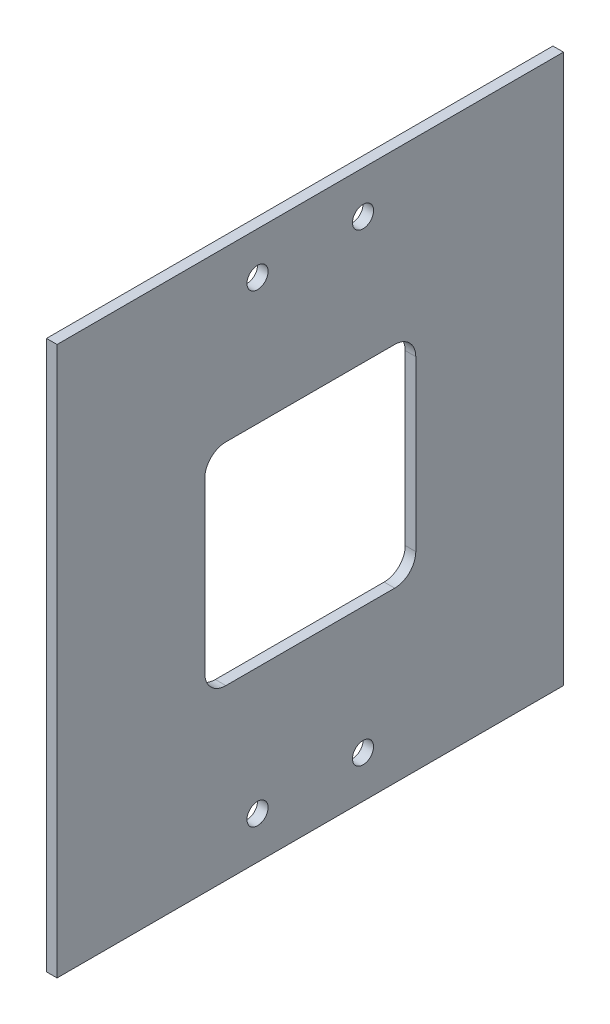
ISO-10303-21;
HEADER;
FILE_DESCRIPTION(('STEP AP214'),'2;1');
FILE_NAME('part.step','',(''),(''),'','','');
FILE_SCHEMA(('AUTOMOTIVE_DESIGN { 1 0 10303 214 1 1 1 1 }'));
ENDSEC;
DATA;
#1=APPLICATION_CONTEXT('core data for automotive mechanical design processes');
#2=APPLICATION_PROTOCOL_DEFINITION('international standard','automotive_design',2000,#1);
#3=PRODUCT_CONTEXT('',#1,'mechanical');
#4=PRODUCT('Part','Part','',(#3));
#5=PRODUCT_RELATED_PRODUCT_CATEGORY('part','',(#4));
#6=PRODUCT_DEFINITION_FORMATION('','',#4);
#7=PRODUCT_DEFINITION_CONTEXT('part definition',#1,'design');
#8=PRODUCT_DEFINITION('design','',#6,#7);
#9=PRODUCT_DEFINITION_SHAPE('','',#8);
#10=(LENGTH_UNIT() NAMED_UNIT(*) SI_UNIT(.MILLI.,.METRE.));
#11=(NAMED_UNIT(*) PLANE_ANGLE_UNIT() SI_UNIT($,.RADIAN.));
#12=(NAMED_UNIT(*) SI_UNIT($,.STERADIAN.) SOLID_ANGLE_UNIT());
#13=UNCERTAINTY_MEASURE_WITH_UNIT(LENGTH_MEASURE(1.E-05),#10,'distance_accuracy_value','');
#14=(GEOMETRIC_REPRESENTATION_CONTEXT(3) GLOBAL_UNCERTAINTY_ASSIGNED_CONTEXT((#13)) GLOBAL_UNIT_ASSIGNED_CONTEXT((#10,
#11,#12)) REPRESENTATION_CONTEXT('',''));
#15=CARTESIAN_POINT('',(0.,0.,0.));
#16=DIRECTION('',(0.,0.,1.));
#17=DIRECTION('',(1.,0.,0.));
#18=AXIS2_PLACEMENT_3D('',#15,#16,#17);
#19=CARTESIAN_POINT('',(3.175,82.55,0.));
#20=DIRECTION('',(0.,0.,-1.));
#21=DIRECTION('',(0.,1.,0.));
#22=AXIS2_PLACEMENT_3D('',#19,#20,#21);
#23=PLANE('',#22);
#24=DIRECTION('',(0.,-1.,0.));
#25=VECTOR('',#24,1.);
#26=CARTESIAN_POINT('',(0.,82.55,0.));
#27=LINE('',#26,#25);
#28=CARTESIAN_POINT('',(0.,82.55,0.));
#29=VERTEX_POINT('',#28);
#30=CARTESIAN_POINT('',(0.,-82.55,0.));
#31=VERTEX_POINT('',#30);
#32=EDGE_CURVE('E183',#29,#31,#27,.T.);
#33=ORIENTED_EDGE('',*,*,#32,.T.);
#34=DIRECTION('',(-1.,0.,0.));
#35=VECTOR('',#34,1.);
#36=CARTESIAN_POINT('',(3.175,-82.55,0.));
#37=LINE('',#36,#35);
#38=CARTESIAN_POINT('',(3.175,-82.55,0.));
#39=VERTEX_POINT('',#38);
#40=EDGE_CURVE('E11',#39,#31,#37,.T.);
#41=ORIENTED_EDGE('',*,*,#40,.F.);
#42=DIRECTION('',(0.,-1.,0.));
#43=VECTOR('',#42,1.);
#44=CARTESIAN_POINT('',(3.175,82.55,0.));
#45=LINE('',#44,#43);
#46=CARTESIAN_POINT('',(3.175,82.55,0.));
#47=VERTEX_POINT('',#46);
#48=EDGE_CURVE('E195',#47,#39,#45,.T.);
#49=ORIENTED_EDGE('',*,*,#48,.F.);
#50=DIRECTION('',(-1.,0.,0.));
#51=VECTOR('',#50,1.);
#52=CARTESIAN_POINT('',(3.175,82.55,0.));
#53=LINE('',#52,#51);
#54=EDGE_CURVE('E205',#47,#29,#53,.T.);
#55=ORIENTED_EDGE('',*,*,#54,.T.);
#56=EDGE_LOOP('',(#33,#41,#49,#55));
#57=FACE_BOUND('',#56,.T.);
#58=ADVANCED_FACE('F34',(#57),#23,.F.);
#59=CARTESIAN_POINT('',(3.175,-82.55,-152.4));
#60=DIRECTION('',(0.,1.,0.));
#61=DIRECTION('',(0.,0.,1.));
#62=AXIS2_PLACEMENT_3D('',#59,#60,#61);
#63=PLANE('',#62);
#64=DIRECTION('',(0.,0.,-1.));
#65=VECTOR('',#64,1.);
#66=CARTESIAN_POINT('',(0.,-82.55,-152.4));
#67=LINE('',#66,#65);
#68=CARTESIAN_POINT('',(0.,-82.55,-152.4));
#69=VERTEX_POINT('',#68);
#70=EDGE_CURVE('E208',#31,#69,#67,.T.);
#71=ORIENTED_EDGE('',*,*,#70,.T.);
#72=DIRECTION('',(-1.,0.,0.));
#73=VECTOR('',#72,1.);
#74=CARTESIAN_POINT('',(3.175,-82.55,-152.4));
#75=LINE('',#74,#73);
#76=CARTESIAN_POINT('',(3.175,-82.55,-152.4));
#77=VERTEX_POINT('',#76);
#78=EDGE_CURVE('E41',#77,#69,#75,.T.);
#79=ORIENTED_EDGE('',*,*,#78,.F.);
#80=DIRECTION('',(0.,0.,-1.));
#81=VECTOR('',#80,1.);
#82=CARTESIAN_POINT('',(3.175,-82.55,-152.4));
#83=LINE('',#82,#81);
#84=EDGE_CURVE('E198',#39,#77,#83,.T.);
#85=ORIENTED_EDGE('',*,*,#84,.F.);
#86=ORIENTED_EDGE('',*,*,#40,.T.);
#87=EDGE_LOOP('',(#71,#79,#85,#86));
#88=FACE_BOUND('',#87,.T.);
#89=ADVANCED_FACE('F236',(#88),#63,.F.);
#90=CARTESIAN_POINT('',(3.175,82.55,-152.4));
#91=DIRECTION('',(0.,0.,1.));
#92=DIRECTION('',(0.,-1.,0.));
#93=AXIS2_PLACEMENT_3D('',#90,#91,#92);
#94=PLANE('',#93);
#95=DIRECTION('',(0.,1.,0.));
#96=VECTOR('',#95,1.);
#97=CARTESIAN_POINT('',(0.,82.55,-152.4));
#98=LINE('',#97,#96);
#99=CARTESIAN_POINT('',(0.,82.55,-152.4));
#100=VERTEX_POINT('',#99);
#101=EDGE_CURVE('E210',#69,#100,#98,.T.);
#102=ORIENTED_EDGE('',*,*,#101,.T.);
#103=DIRECTION('',(-1.,0.,0.));
#104=VECTOR('',#103,1.);
#105=CARTESIAN_POINT('',(3.175,82.55,-152.4));
#106=LINE('',#105,#104);
#107=CARTESIAN_POINT('',(3.175,82.55,-152.4));
#108=VERTEX_POINT('',#107);
#109=EDGE_CURVE('E215',#108,#100,#106,.T.);
#110=ORIENTED_EDGE('',*,*,#109,.F.);
#111=DIRECTION('',(0.,1.,0.));
#112=VECTOR('',#111,1.);
#113=CARTESIAN_POINT('',(3.175,82.55,-152.4));
#114=LINE('',#113,#112);
#115=EDGE_CURVE('E201',#77,#108,#114,.T.);
#116=ORIENTED_EDGE('',*,*,#115,.F.);
#117=ORIENTED_EDGE('',*,*,#78,.T.);
#118=EDGE_LOOP('',(#102,#110,#116,#117));
#119=FACE_BOUND('',#118,.T.);
#120=ADVANCED_FACE('F222',(#119),#94,.F.);
#121=CARTESIAN_POINT('',(3.175,82.55,-152.4));
#122=DIRECTION('',(0.,-1.,0.));
#123=DIRECTION('',(0.,0.,-1.));
#124=AXIS2_PLACEMENT_3D('',#121,#122,#123);
#125=PLANE('',#124);
#126=DIRECTION('',(0.,0.,1.));
#127=VECTOR('',#126,1.);
#128=CARTESIAN_POINT('',(0.,82.55,-152.4));
#129=LINE('',#128,#127);
#130=EDGE_CURVE('E199',#100,#29,#129,.T.);
#131=ORIENTED_EDGE('',*,*,#130,.T.);
#132=ORIENTED_EDGE('',*,*,#54,.F.);
#133=DIRECTION('',(0.,0.,1.));
#134=VECTOR('',#133,1.);
#135=CARTESIAN_POINT('',(3.175,82.55,-152.4));
#136=LINE('',#135,#134);
#137=EDGE_CURVE('E203',#108,#47,#136,.T.);
#138=ORIENTED_EDGE('',*,*,#137,.F.);
#139=ORIENTED_EDGE('',*,*,#109,.T.);
#140=EDGE_LOOP('',(#131,#132,#138,#139));
#141=FACE_BOUND('',#140,.T.);
#142=ADVANCED_FACE('F231',(#141),#125,.F.);
#143=CARTESIAN_POINT('',(3.175,-82.55,0.));
#144=DIRECTION('',(-1.,0.,0.));
#145=DIRECTION('',(0.,0.,1.));
#146=AXIS2_PLACEMENT_3D('',#143,#144,#145);
#147=PLANE('',#146);
#148=CARTESIAN_POINT('',(3.175,-69.85,-60.325));
#149=DIRECTION('',(-1.,0.,0.));
#150=DIRECTION('',(0.,0.,1.));
#151=AXIS2_PLACEMENT_3D('',#148,#149,#150);
#152=CIRCLE('',#151,3.175);
#153=CARTESIAN_POINT('',(3.175,-69.85,-57.15));
#154=VERTEX_POINT('',#153);
#155=EDGE_CURVE('E299',#154,#154,#152,.T.);
#156=ORIENTED_EDGE('',*,*,#155,.T.);
#157=EDGE_LOOP('',(#156));
#158=FACE_BOUND('',#157,.T.);
#159=CARTESIAN_POINT('',(3.175,-69.85,-92.075));
#160=DIRECTION('',(-1.,0.,0.));
#161=DIRECTION('',(0.,0.,1.));
#162=AXIS2_PLACEMENT_3D('',#159,#160,#161);
#163=CIRCLE('',#162,3.175);
#164=CARTESIAN_POINT('',(3.175,-69.85,-88.9));
#165=VERTEX_POINT('',#164);
#166=EDGE_CURVE('E307',#165,#165,#163,.T.);
#167=ORIENTED_EDGE('',*,*,#166,.T.);
#168=EDGE_LOOP('',(#167));
#169=FACE_BOUND('',#168,.T.);
#170=CARTESIAN_POINT('',(3.175,69.85,-92.075));
#171=DIRECTION('',(-1.,0.,0.));
#172=DIRECTION('',(0.,0.,1.));
#173=AXIS2_PLACEMENT_3D('',#170,#171,#172);
#174=CIRCLE('',#173,3.175);
#175=CARTESIAN_POINT('',(3.175,69.85,-88.9));
#176=VERTEX_POINT('',#175);
#177=EDGE_CURVE('E313',#176,#176,#174,.T.);
#178=ORIENTED_EDGE('',*,*,#177,.T.);
#179=EDGE_LOOP('',(#178));
#180=FACE_BOUND('',#179,.T.);
#181=CARTESIAN_POINT('',(3.175,69.85,-60.325));
#182=DIRECTION('',(-1.,0.,0.));
#183=DIRECTION('',(0.,0.,1.));
#184=AXIS2_PLACEMENT_3D('',#181,#182,#183);
#185=CIRCLE('',#184,3.175);
#186=CARTESIAN_POINT('',(3.175,69.85,-57.15));
#187=VERTEX_POINT('',#186);
#188=EDGE_CURVE('E165',#187,#187,#185,.T.);
#189=ORIENTED_EDGE('',*,*,#188,.T.);
#190=EDGE_LOOP('',(#189));
#191=FACE_BOUND('',#190,.T.);
#192=CARTESIAN_POINT('',(3.175,-25.4,-101.6));
#193=DIRECTION('',(-1.,0.,0.));
#194=DIRECTION('',(0.,0.,1.));
#195=AXIS2_PLACEMENT_3D('',#192,#193,#194);
#196=CIRCLE('',#195,6.35000000000001);
#197=CARTESIAN_POINT('',(3.175,-25.4,-107.95));
#198=VERTEX_POINT('',#197);
#199=CARTESIAN_POINT('',(3.175,-31.75,-101.6));
#200=VERTEX_POINT('',#199);
#201=EDGE_CURVE('E130',#198,#200,#196,.T.);
#202=ORIENTED_EDGE('',*,*,#201,.T.);
#203=DIRECTION('',(0.,0.,1.));
#204=VECTOR('',#203,1.);
#205=CARTESIAN_POINT('',(3.175,-31.75,-76.2));
#206=LINE('',#205,#204);
#207=CARTESIAN_POINT('',(3.175,-31.75,-50.8));
#208=VERTEX_POINT('',#207);
#209=EDGE_CURVE('E124',#200,#208,#206,.T.);
#210=ORIENTED_EDGE('',*,*,#209,.T.);
#211=CARTESIAN_POINT('',(3.175,-25.4,-50.8));
#212=DIRECTION('',(-1.,0.,0.));
#213=DIRECTION('',(0.,0.,1.));
#214=AXIS2_PLACEMENT_3D('',#211,#212,#213);
#215=CIRCLE('',#214,6.35000000000001);
#216=CARTESIAN_POINT('',(3.175,-25.4,-44.45));
#217=VERTEX_POINT('',#216);
#218=EDGE_CURVE('E133',#208,#217,#215,.T.);
#219=ORIENTED_EDGE('',*,*,#218,.T.);
#220=DIRECTION('',(0.,1.,0.));
#221=VECTOR('',#220,1.);
#222=CARTESIAN_POINT('',(3.175,-174.906065520897,-44.45));
#223=LINE('',#222,#221);
#224=CARTESIAN_POINT('',(3.175,25.4,-44.45));
#225=VERTEX_POINT('',#224);
#226=EDGE_CURVE('E48',#217,#225,#223,.T.);
#227=ORIENTED_EDGE('',*,*,#226,.T.);
#228=CARTESIAN_POINT('',(3.175,25.4,-50.8));
#229=DIRECTION('',(-1.,0.,0.));
#230=DIRECTION('',(0.,0.,1.));
#231=AXIS2_PLACEMENT_3D('',#228,#229,#230);
#232=CIRCLE('',#231,6.35000000000001);
#233=CARTESIAN_POINT('',(3.175,31.75,-50.8));
#234=VERTEX_POINT('',#233);
#235=EDGE_CURVE('E151',#225,#234,#232,.T.);
#236=ORIENTED_EDGE('',*,*,#235,.T.);
#237=DIRECTION('',(0.,0.,-1.));
#238=VECTOR('',#237,1.);
#239=CARTESIAN_POINT('',(3.175,31.75,-76.2));
#240=LINE('',#239,#238);
#241=CARTESIAN_POINT('',(3.175,31.75,-101.6));
#242=VERTEX_POINT('',#241);
#243=EDGE_CURVE('E154',#234,#242,#240,.T.);
#244=ORIENTED_EDGE('',*,*,#243,.T.);
#245=CARTESIAN_POINT('',(3.175,25.4,-101.6));
#246=DIRECTION('',(-1.,0.,0.));
#247=DIRECTION('',(0.,0.,1.));
#248=AXIS2_PLACEMENT_3D('',#245,#246,#247);
#249=CIRCLE('',#248,6.35000000000001);
#250=CARTESIAN_POINT('',(3.175,25.4,-107.95));
#251=VERTEX_POINT('',#250);
#252=EDGE_CURVE('E157',#242,#251,#249,.T.);
#253=ORIENTED_EDGE('',*,*,#252,.T.);
#254=DIRECTION('',(0.,-1.,0.));
#255=VECTOR('',#254,1.);
#256=CARTESIAN_POINT('',(3.175,-174.906065520897,-107.95));
#257=LINE('',#256,#255);
#258=EDGE_CURVE('E160',#251,#198,#257,.T.);
#259=ORIENTED_EDGE('',*,*,#258,.T.);
#260=EDGE_LOOP('',(#202,#210,#219,#227,#236,#244,#253,#259));
#261=FACE_BOUND('',#260,.T.);
#262=ORIENTED_EDGE('',*,*,#48,.T.);
#263=ORIENTED_EDGE('',*,*,#84,.T.);
#264=ORIENTED_EDGE('',*,*,#115,.T.);
#265=ORIENTED_EDGE('',*,*,#137,.T.);
#266=EDGE_LOOP('',(#262,#263,#264,#265));
#267=FACE_BOUND('',#266,.T.);
#268=ADVANCED_FACE('F137',(#158,#169,#180,#191,#261,#267),#147,.F.);
#269=CARTESIAN_POINT('',(0.,-82.55,0.));
#270=DIRECTION('',(-1.,0.,0.));
#271=DIRECTION('',(0.,0.,1.));
#272=AXIS2_PLACEMENT_3D('',#269,#270,#271);
#273=PLANE('',#272);
#274=CARTESIAN_POINT('',(0.,-69.85,-60.325));
#275=DIRECTION('',(-1.,0.,0.));
#276=DIRECTION('',(0.,0.,1.));
#277=AXIS2_PLACEMENT_3D('',#274,#275,#276);
#278=CIRCLE('',#277,3.175);
#279=CARTESIAN_POINT('',(0.,-69.85,-57.15));
#280=VERTEX_POINT('',#279);
#281=EDGE_CURVE('E302',#280,#280,#278,.T.);
#282=ORIENTED_EDGE('',*,*,#281,.F.);
#283=EDGE_LOOP('',(#282));
#284=FACE_BOUND('',#283,.T.);
#285=CARTESIAN_POINT('',(0.,-69.85,-92.075));
#286=DIRECTION('',(-1.,0.,0.));
#287=DIRECTION('',(0.,0.,1.));
#288=AXIS2_PLACEMENT_3D('',#285,#286,#287);
#289=CIRCLE('',#288,3.175);
#290=CARTESIAN_POINT('',(0.,-69.85,-88.9));
#291=VERTEX_POINT('',#290);
#292=EDGE_CURVE('E304',#291,#291,#289,.T.);
#293=ORIENTED_EDGE('',*,*,#292,.F.);
#294=EDGE_LOOP('',(#293));
#295=FACE_BOUND('',#294,.T.);
#296=CARTESIAN_POINT('',(0.,69.85,-92.075));
#297=DIRECTION('',(-1.,0.,0.));
#298=DIRECTION('',(0.,0.,1.));
#299=AXIS2_PLACEMENT_3D('',#296,#297,#298);
#300=CIRCLE('',#299,3.175);
#301=CARTESIAN_POINT('',(0.,69.85,-88.9));
#302=VERTEX_POINT('',#301);
#303=EDGE_CURVE('E310',#302,#302,#300,.T.);
#304=ORIENTED_EDGE('',*,*,#303,.F.);
#305=EDGE_LOOP('',(#304));
#306=FACE_BOUND('',#305,.T.);
#307=CARTESIAN_POINT('',(0.,69.85,-60.325));
#308=DIRECTION('',(-1.,0.,0.));
#309=DIRECTION('',(0.,0.,1.));
#310=AXIS2_PLACEMENT_3D('',#307,#308,#309);
#311=CIRCLE('',#310,3.175);
#312=CARTESIAN_POINT('',(0.,69.85,-57.15));
#313=VERTEX_POINT('',#312);
#314=EDGE_CURVE('E147',#313,#313,#311,.T.);
#315=ORIENTED_EDGE('',*,*,#314,.F.);
#316=EDGE_LOOP('',(#315));
#317=FACE_BOUND('',#316,.T.);
#318=DIRECTION('',(0.,0.,1.));
#319=VECTOR('',#318,1.);
#320=CARTESIAN_POINT('',(0.,-31.75,-76.2));
#321=LINE('',#320,#319);
#322=CARTESIAN_POINT('',(0.,-31.75,-101.6));
#323=VERTEX_POINT('',#322);
#324=CARTESIAN_POINT('',(0.,-31.75,-50.8));
#325=VERTEX_POINT('',#324);
#326=EDGE_CURVE('E56',#323,#325,#321,.T.);
#327=ORIENTED_EDGE('',*,*,#326,.F.);
#328=CARTESIAN_POINT('',(0.,-25.4,-101.6));
#329=DIRECTION('',(-1.,0.,0.));
#330=DIRECTION('',(0.,0.,1.));
#331=AXIS2_PLACEMENT_3D('',#328,#329,#330);
#332=CIRCLE('',#331,6.35000000000001);
#333=CARTESIAN_POINT('',(0.,-25.4,-107.95));
#334=VERTEX_POINT('',#333);
#335=EDGE_CURVE('E141',#334,#323,#332,.T.);
#336=ORIENTED_EDGE('',*,*,#335,.F.);
#337=DIRECTION('',(0.,-1.,0.));
#338=VECTOR('',#337,1.);
#339=CARTESIAN_POINT('',(0.,-174.906065520897,-107.95));
#340=LINE('',#339,#338);
#341=CARTESIAN_POINT('',(0.,25.4,-107.95));
#342=VERTEX_POINT('',#341);
#343=EDGE_CURVE('E144',#342,#334,#340,.T.);
#344=ORIENTED_EDGE('',*,*,#343,.F.);
#345=CARTESIAN_POINT('',(0.,25.4,-101.6));
#346=DIRECTION('',(-1.,0.,0.));
#347=DIRECTION('',(0.,0.,1.));
#348=AXIS2_PLACEMENT_3D('',#345,#346,#347);
#349=CIRCLE('',#348,6.35000000000001);
#350=CARTESIAN_POINT('',(0.,31.75,-101.6));
#351=VERTEX_POINT('',#350);
#352=EDGE_CURVE('E176',#351,#342,#349,.T.);
#353=ORIENTED_EDGE('',*,*,#352,.F.);
#354=DIRECTION('',(0.,0.,-1.));
#355=VECTOR('',#354,1.);
#356=CARTESIAN_POINT('',(0.,31.75,-76.2));
#357=LINE('',#356,#355);
#358=CARTESIAN_POINT('',(0.,31.75,-50.8));
#359=VERTEX_POINT('',#358);
#360=EDGE_CURVE('E173',#359,#351,#357,.T.);
#361=ORIENTED_EDGE('',*,*,#360,.F.);
#362=CARTESIAN_POINT('',(0.,25.4,-50.8));
#363=DIRECTION('',(-1.,0.,0.));
#364=DIRECTION('',(0.,0.,1.));
#365=AXIS2_PLACEMENT_3D('',#362,#363,#364);
#366=CIRCLE('',#365,6.35000000000001);
#367=CARTESIAN_POINT('',(0.,25.4,-44.45));
#368=VERTEX_POINT('',#367);
#369=EDGE_CURVE('E170',#368,#359,#366,.T.);
#370=ORIENTED_EDGE('',*,*,#369,.F.);
#371=DIRECTION('',(0.,1.,0.));
#372=VECTOR('',#371,1.);
#373=CARTESIAN_POINT('',(0.,-174.906065520897,-44.45));
#374=LINE('',#373,#372);
#375=CARTESIAN_POINT('',(0.,-25.4,-44.45));
#376=VERTEX_POINT('',#375);
#377=EDGE_CURVE('E167',#376,#368,#374,.T.);
#378=ORIENTED_EDGE('',*,*,#377,.F.);
#379=CARTESIAN_POINT('',(0.,-25.4,-50.8));
#380=DIRECTION('',(-1.,0.,0.));
#381=DIRECTION('',(0.,0.,1.));
#382=AXIS2_PLACEMENT_3D('',#379,#380,#381);
#383=CIRCLE('',#382,6.35000000000001);
#384=EDGE_CURVE('E164',#325,#376,#383,.T.);
#385=ORIENTED_EDGE('',*,*,#384,.F.);
#386=EDGE_LOOP('',(#327,#336,#344,#353,#361,#370,#378,#385));
#387=FACE_BOUND('',#386,.T.);
#388=ORIENTED_EDGE('',*,*,#32,.F.);
#389=ORIENTED_EDGE('',*,*,#130,.F.);
#390=ORIENTED_EDGE('',*,*,#101,.F.);
#391=ORIENTED_EDGE('',*,*,#70,.F.);
#392=EDGE_LOOP('',(#388,#389,#390,#391));
#393=FACE_BOUND('',#392,.T.);
#394=ADVANCED_FACE('F228',(#284,#295,#306,#317,#387,#393),#273,.T.);
#395=CARTESIAN_POINT('',(3.175,-31.75,-76.2));
#396=DIRECTION('',(0.,-1.,0.));
#397=DIRECTION('',(0.,0.,-1.));
#398=AXIS2_PLACEMENT_3D('',#395,#396,#397);
#399=PLANE('',#398);
#400=ORIENTED_EDGE('',*,*,#326,.T.);
#401=DIRECTION('',(-1.,0.,0.));
#402=VECTOR('',#401,1.);
#403=CARTESIAN_POINT('',(3.175,-31.75,-50.8));
#404=LINE('',#403,#402);
#405=EDGE_CURVE('E120',#208,#325,#404,.T.);
#406=ORIENTED_EDGE('',*,*,#405,.F.);
#407=ORIENTED_EDGE('',*,*,#209,.F.);
#408=DIRECTION('',(-1.,0.,0.));
#409=VECTOR('',#408,1.);
#410=CARTESIAN_POINT('',(3.175,-31.75,-101.6));
#411=LINE('',#410,#409);
#412=EDGE_CURVE('E181',#200,#323,#411,.T.);
#413=ORIENTED_EDGE('',*,*,#412,.T.);
#414=EDGE_LOOP('',(#400,#406,#407,#413));
#415=FACE_BOUND('',#414,.T.);
#416=ADVANCED_FACE('F122',(#415),#399,.F.);
#417=CARTESIAN_POINT('',(3.175,-25.4,-101.6));
#418=DIRECTION('',(-1.,0.,0.));
#419=DIRECTION('',(0.,0.,1.));
#420=AXIS2_PLACEMENT_3D('',#417,#418,#419);
#421=CYLINDRICAL_SURFACE('',#420,6.35000000000001);
#422=ORIENTED_EDGE('',*,*,#335,.T.);
#423=ORIENTED_EDGE('',*,*,#412,.F.);
#424=ORIENTED_EDGE('',*,*,#201,.F.);
#425=DIRECTION('',(-1.,0.,0.));
#426=VECTOR('',#425,1.);
#427=CARTESIAN_POINT('',(3.175,-25.4,-107.95));
#428=LINE('',#427,#426);
#429=EDGE_CURVE('E184',#198,#334,#428,.T.);
#430=ORIENTED_EDGE('',*,*,#429,.T.);
#431=EDGE_LOOP('',(#422,#423,#424,#430));
#432=FACE_BOUND('',#431,.T.);
#433=ADVANCED_FACE('F254',(#432),#421,.F.);
#434=CARTESIAN_POINT('',(3.175,-174.906065520897,-107.95));
#435=DIRECTION('',(0.,0.,-1.));
#436=DIRECTION('',(-1.,0.,0.));
#437=AXIS2_PLACEMENT_3D('',#434,#435,#436);
#438=PLANE('',#437);
#439=ORIENTED_EDGE('',*,*,#343,.T.);
#440=ORIENTED_EDGE('',*,*,#429,.F.);
#441=ORIENTED_EDGE('',*,*,#258,.F.);
#442=DIRECTION('',(-1.,0.,0.));
#443=VECTOR('',#442,1.);
#444=CARTESIAN_POINT('',(3.175,25.4,-107.95));
#445=LINE('',#444,#443);
#446=EDGE_CURVE('E186',#251,#342,#445,.T.);
#447=ORIENTED_EDGE('',*,*,#446,.T.);
#448=EDGE_LOOP('',(#439,#440,#441,#447));
#449=FACE_BOUND('',#448,.T.);
#450=ADVANCED_FACE('F272',(#449),#438,.F.);
#451=CARTESIAN_POINT('',(3.175,25.4,-101.6));
#452=DIRECTION('',(-1.,0.,0.));
#453=DIRECTION('',(0.,0.,1.));
#454=AXIS2_PLACEMENT_3D('',#451,#452,#453);
#455=CYLINDRICAL_SURFACE('',#454,6.35000000000001);
#456=ORIENTED_EDGE('',*,*,#352,.T.);
#457=ORIENTED_EDGE('',*,*,#446,.F.);
#458=ORIENTED_EDGE('',*,*,#252,.F.);
#459=DIRECTION('',(-1.,0.,0.));
#460=VECTOR('',#459,1.);
#461=CARTESIAN_POINT('',(3.175,31.75,-101.6));
#462=LINE('',#461,#460);
#463=EDGE_CURVE('E188',#242,#351,#462,.T.);
#464=ORIENTED_EDGE('',*,*,#463,.T.);
#465=EDGE_LOOP('',(#456,#457,#458,#464));
#466=FACE_BOUND('',#465,.T.);
#467=ADVANCED_FACE('F268',(#466),#455,.F.);
#468=CARTESIAN_POINT('',(3.175,31.75,-76.2));
#469=DIRECTION('',(0.,1.,0.));
#470=DIRECTION('',(0.,0.,1.));
#471=AXIS2_PLACEMENT_3D('',#468,#469,#470);
#472=PLANE('',#471);
#473=ORIENTED_EDGE('',*,*,#360,.T.);
#474=ORIENTED_EDGE('',*,*,#463,.F.);
#475=ORIENTED_EDGE('',*,*,#243,.F.);
#476=DIRECTION('',(-1.,0.,0.));
#477=VECTOR('',#476,1.);
#478=CARTESIAN_POINT('',(3.175,31.75,-50.8));
#479=LINE('',#478,#477);
#480=EDGE_CURVE('E190',#234,#359,#479,.T.);
#481=ORIENTED_EDGE('',*,*,#480,.T.);
#482=EDGE_LOOP('',(#473,#474,#475,#481));
#483=FACE_BOUND('',#482,.T.);
#484=ADVANCED_FACE('F264',(#483),#472,.F.);
#485=CARTESIAN_POINT('',(3.175,25.4,-50.8));
#486=DIRECTION('',(-1.,0.,0.));
#487=DIRECTION('',(0.,0.,1.));
#488=AXIS2_PLACEMENT_3D('',#485,#486,#487);
#489=CYLINDRICAL_SURFACE('',#488,6.35000000000001);
#490=ORIENTED_EDGE('',*,*,#369,.T.);
#491=ORIENTED_EDGE('',*,*,#480,.F.);
#492=ORIENTED_EDGE('',*,*,#235,.F.);
#493=DIRECTION('',(-1.,0.,0.));
#494=VECTOR('',#493,1.);
#495=CARTESIAN_POINT('',(3.175,25.4,-44.45));
#496=LINE('',#495,#494);
#497=EDGE_CURVE('E192',#225,#368,#496,.T.);
#498=ORIENTED_EDGE('',*,*,#497,.T.);
#499=EDGE_LOOP('',(#490,#491,#492,#498));
#500=FACE_BOUND('',#499,.T.);
#501=ADVANCED_FACE('F261',(#500),#489,.F.);
#502=CARTESIAN_POINT('',(3.175,-174.906065520897,-44.45));
#503=DIRECTION('',(0.,0.,1.));
#504=DIRECTION('',(0.,-1.,0.));
#505=AXIS2_PLACEMENT_3D('',#502,#503,#504);
#506=PLANE('',#505);
#507=ORIENTED_EDGE('',*,*,#377,.T.);
#508=ORIENTED_EDGE('',*,*,#497,.F.);
#509=ORIENTED_EDGE('',*,*,#226,.F.);
#510=DIRECTION('',(-1.,0.,0.));
#511=VECTOR('',#510,1.);
#512=CARTESIAN_POINT('',(3.175,-25.4,-44.45));
#513=LINE('',#512,#511);
#514=EDGE_CURVE('E129',#217,#376,#513,.T.);
#515=ORIENTED_EDGE('',*,*,#514,.T.);
#516=EDGE_LOOP('',(#507,#508,#509,#515));
#517=FACE_BOUND('',#516,.T.);
#518=ADVANCED_FACE('F258',(#517),#506,.F.);
#519=CARTESIAN_POINT('',(3.175,-25.4,-50.8));
#520=DIRECTION('',(-1.,0.,0.));
#521=DIRECTION('',(0.,0.,1.));
#522=AXIS2_PLACEMENT_3D('',#519,#520,#521);
#523=CYLINDRICAL_SURFACE('',#522,6.35000000000001);
#524=ORIENTED_EDGE('',*,*,#384,.T.);
#525=ORIENTED_EDGE('',*,*,#514,.F.);
#526=ORIENTED_EDGE('',*,*,#218,.F.);
#527=ORIENTED_EDGE('',*,*,#405,.T.);
#528=EDGE_LOOP('',(#524,#525,#526,#527));
#529=FACE_BOUND('',#528,.T.);
#530=ADVANCED_FACE('F134',(#529),#523,.F.);
#531=CARTESIAN_POINT('',(3.175,69.85,-60.325));
#532=DIRECTION('',(-1.,0.,0.));
#533=DIRECTION('',(0.,0.,1.));
#534=AXIS2_PLACEMENT_3D('',#531,#532,#533);
#535=CYLINDRICAL_SURFACE('',#534,3.175);
#536=ORIENTED_EDGE('',*,*,#188,.F.);
#537=EDGE_LOOP('',(#536));
#538=FACE_BOUND('',#537,.T.);
#539=ORIENTED_EDGE('',*,*,#314,.T.);
#540=EDGE_LOOP('',(#539));
#541=FACE_BOUND('',#540,.T.);
#542=ADVANCED_FACE('F257',(#538,#541),#535,.F.);
#543=CARTESIAN_POINT('',(3.175,69.85,-92.075));
#544=DIRECTION('',(-1.,0.,0.));
#545=DIRECTION('',(0.,0.,1.));
#546=AXIS2_PLACEMENT_3D('',#543,#544,#545);
#547=CYLINDRICAL_SURFACE('',#546,3.175);
#548=ORIENTED_EDGE('',*,*,#177,.F.);
#549=EDGE_LOOP('',(#548));
#550=FACE_BOUND('',#549,.T.);
#551=ORIENTED_EDGE('',*,*,#303,.T.);
#552=EDGE_LOOP('',(#551));
#553=FACE_BOUND('',#552,.T.);
#554=ADVANCED_FACE('F282',(#550,#553),#547,.F.);
#555=CARTESIAN_POINT('',(3.175,-69.85,-92.075));
#556=DIRECTION('',(-1.,0.,0.));
#557=DIRECTION('',(0.,0.,1.));
#558=AXIS2_PLACEMENT_3D('',#555,#556,#557);
#559=CYLINDRICAL_SURFACE('',#558,3.175);
#560=ORIENTED_EDGE('',*,*,#166,.F.);
#561=EDGE_LOOP('',(#560));
#562=FACE_BOUND('',#561,.T.);
#563=ORIENTED_EDGE('',*,*,#292,.T.);
#564=EDGE_LOOP('',(#563));
#565=FACE_BOUND('',#564,.T.);
#566=ADVANCED_FACE('F286',(#562,#565),#559,.F.);
#567=CARTESIAN_POINT('',(3.175,-69.85,-60.325));
#568=DIRECTION('',(-1.,0.,0.));
#569=DIRECTION('',(0.,0.,1.));
#570=AXIS2_PLACEMENT_3D('',#567,#568,#569);
#571=CYLINDRICAL_SURFACE('',#570,3.175);
#572=ORIENTED_EDGE('',*,*,#155,.F.);
#573=EDGE_LOOP('',(#572));
#574=FACE_BOUND('',#573,.T.);
#575=ORIENTED_EDGE('',*,*,#281,.T.);
#576=EDGE_LOOP('',(#575));
#577=FACE_BOUND('',#576,.T.);
#578=ADVANCED_FACE('F290',(#574,#577),#571,.F.);
#579=CLOSED_SHELL('',(#58,#89,#120,#142,#268,#394,#416,#433,#450,#467,#484,#501,#518,#530,#542,
#554,#566,#578));
#580=MANIFOLD_SOLID_BREP('B2',#579);
#581=ADVANCED_BREP_SHAPE_REPRESENTATION('',(#18,#580),#14);
#582=SHAPE_DEFINITION_REPRESENTATION(#9,#581);
ENDSEC;
END-ISO-10303-21;
